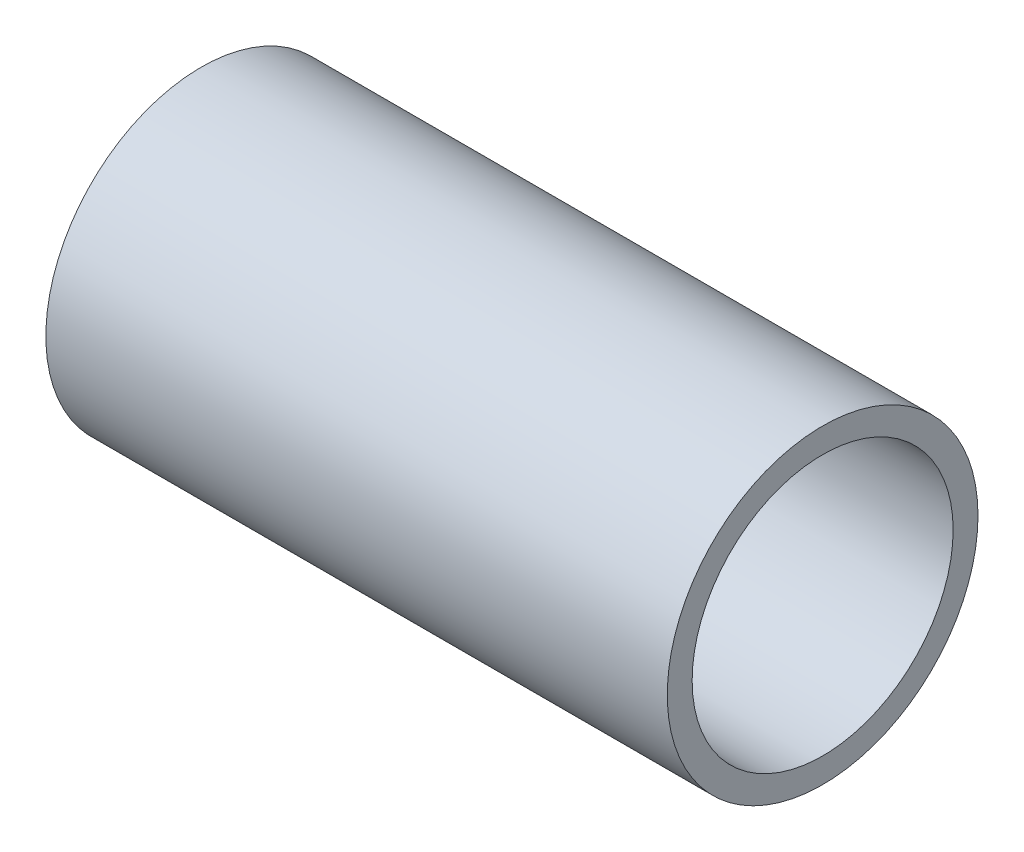
ISO-10303-21;
HEADER;
FILE_DESCRIPTION(('STEP AP214'),'2;1');
FILE_NAME('part.step','',(''),(''),'','','');
FILE_SCHEMA(('AUTOMOTIVE_DESIGN { 1 0 10303 214 1 1 1 1 }'));
ENDSEC;
DATA;
#1=APPLICATION_CONTEXT('core data for automotive mechanical design processes');
#2=APPLICATION_PROTOCOL_DEFINITION('international standard','automotive_design',2000,#1);
#3=PRODUCT_CONTEXT('',#1,'mechanical');
#4=PRODUCT('Part','Part','',(#3));
#5=PRODUCT_RELATED_PRODUCT_CATEGORY('part','',(#4));
#6=PRODUCT_DEFINITION_FORMATION('','',#4);
#7=PRODUCT_DEFINITION_CONTEXT('part definition',#1,'design');
#8=PRODUCT_DEFINITION('design','',#6,#7);
#9=PRODUCT_DEFINITION_SHAPE('','',#8);
#10=(LENGTH_UNIT() NAMED_UNIT(*) SI_UNIT(.MILLI.,.METRE.));
#11=(NAMED_UNIT(*) PLANE_ANGLE_UNIT() SI_UNIT($,.RADIAN.));
#12=(NAMED_UNIT(*) SI_UNIT($,.STERADIAN.) SOLID_ANGLE_UNIT());
#13=UNCERTAINTY_MEASURE_WITH_UNIT(LENGTH_MEASURE(1.E-05),#10,'distance_accuracy_value','');
#14=(GEOMETRIC_REPRESENTATION_CONTEXT(3) GLOBAL_UNCERTAINTY_ASSIGNED_CONTEXT((#13)) GLOBAL_UNIT_ASSIGNED_CONTEXT((#10,
#11,#12)) REPRESENTATION_CONTEXT('',''));
#15=CARTESIAN_POINT('',(0.,0.,0.));
#16=DIRECTION('',(0.,0.,1.));
#17=DIRECTION('',(1.,0.,0.));
#18=AXIS2_PLACEMENT_3D('',#15,#16,#17);
#19=CARTESIAN_POINT('',(38.1,0.,0.));
#20=DIRECTION('',(-1.,0.,0.));
#21=DIRECTION('',(0.,0.,1.));
#22=AXIS2_PLACEMENT_3D('',#19,#20,#21);
#23=CYLINDRICAL_SURFACE('',#22,9.525);
#24=CARTESIAN_POINT('',(38.1,0.,0.));
#25=DIRECTION('',(1.,0.,0.));
#26=DIRECTION('',(0.,0.,-1.));
#27=AXIS2_PLACEMENT_3D('',#24,#25,#26);
#28=CIRCLE('',#27,9.525);
#29=CARTESIAN_POINT('',(38.1,0.,-9.525));
#30=VERTEX_POINT('',#29);
#31=EDGE_CURVE('E10',#30,#30,#28,.T.);
#32=ORIENTED_EDGE('',*,*,#31,.F.);
#33=EDGE_LOOP('',(#32));
#34=FACE_BOUND('',#33,.T.);
#35=CARTESIAN_POINT('',(0.,0.,0.));
#36=DIRECTION('',(1.,0.,0.));
#37=DIRECTION('',(0.,0.,-1.));
#38=AXIS2_PLACEMENT_3D('',#35,#36,#37);
#39=CIRCLE('',#38,9.525);
#40=CARTESIAN_POINT('',(0.,0.,-9.525));
#41=VERTEX_POINT('',#40);
#42=EDGE_CURVE('E35',#41,#41,#39,.T.);
#43=ORIENTED_EDGE('',*,*,#42,.T.);
#44=EDGE_LOOP('',(#43));
#45=FACE_BOUND('',#44,.T.);
#46=ADVANCED_FACE('F32',(#34,#45),#23,.T.);
#47=CARTESIAN_POINT('',(38.1,0.,0.));
#48=DIRECTION('',(1.,0.,0.));
#49=DIRECTION('',(0.,0.,-1.));
#50=AXIS2_PLACEMENT_3D('',#47,#48,#49);
#51=PLANE('',#50);
#52=CARTESIAN_POINT('',(38.1,0.,0.));
#53=DIRECTION('',(-1.,0.,0.));
#54=DIRECTION('',(0.,0.,1.));
#55=AXIS2_PLACEMENT_3D('',#52,#53,#54);
#56=CIRCLE('',#55,8.001);
#57=CARTESIAN_POINT('',(38.1,0.,8.001));
#58=VERTEX_POINT('',#57);
#59=EDGE_CURVE('E47',#58,#58,#56,.T.);
#60=ORIENTED_EDGE('',*,*,#59,.T.);
#61=EDGE_LOOP('',(#60));
#62=FACE_BOUND('',#61,.T.);
#63=ORIENTED_EDGE('',*,*,#31,.T.);
#64=EDGE_LOOP('',(#63));
#65=FACE_BOUND('',#64,.T.);
#66=ADVANCED_FACE('F56',(#62,#65),#51,.T.);
#67=CARTESIAN_POINT('',(0.,0.,0.));
#68=DIRECTION('',(1.,0.,0.));
#69=DIRECTION('',(0.,0.,-1.));
#70=AXIS2_PLACEMENT_3D('',#67,#68,#69);
#71=PLANE('',#70);
#72=CARTESIAN_POINT('',(0.,0.,0.));
#73=DIRECTION('',(-1.,0.,0.));
#74=DIRECTION('',(0.,0.,1.));
#75=AXIS2_PLACEMENT_3D('',#72,#73,#74);
#76=CIRCLE('',#75,8.509);
#77=CARTESIAN_POINT('',(0.,0.,8.509));
#78=VERTEX_POINT('',#77);
#79=EDGE_CURVE('E44',#78,#78,#76,.T.);
#80=ORIENTED_EDGE('',*,*,#79,.F.);
#81=EDGE_LOOP('',(#80));
#82=FACE_BOUND('',#81,.T.);
#83=ORIENTED_EDGE('',*,*,#42,.F.);
#84=EDGE_LOOP('',(#83));
#85=FACE_BOUND('',#84,.T.);
#86=ADVANCED_FACE('F73',(#82,#85),#71,.F.);
#87=CARTESIAN_POINT('',(1.524,0.,0.));
#88=DIRECTION('',(-1.,0.,0.));
#89=DIRECTION('',(0.,0.,1.));
#90=AXIS2_PLACEMENT_3D('',#87,#88,#89);
#91=CYLINDRICAL_SURFACE('',#90,8.509);
#92=CARTESIAN_POINT('',(1.524,0.,0.));
#93=DIRECTION('',(-1.,0.,0.));
#94=DIRECTION('',(0.,0.,1.));
#95=AXIS2_PLACEMENT_3D('',#92,#93,#94);
#96=CIRCLE('',#95,8.509);
#97=CARTESIAN_POINT('',(1.524,0.,8.509));
#98=VERTEX_POINT('',#97);
#99=EDGE_CURVE('E42',#98,#98,#96,.T.);
#100=ORIENTED_EDGE('',*,*,#99,.F.);
#101=EDGE_LOOP('',(#100));
#102=FACE_BOUND('',#101,.T.);
#103=ORIENTED_EDGE('',*,*,#79,.T.);
#104=EDGE_LOOP('',(#103));
#105=FACE_BOUND('',#104,.T.);
#106=ADVANCED_FACE('F67',(#102,#105),#91,.F.);
#107=CARTESIAN_POINT('',(1.524,0.,0.));
#108=DIRECTION('',(-1.,0.,0.));
#109=DIRECTION('',(0.,0.,1.));
#110=AXIS2_PLACEMENT_3D('',#107,#108,#109);
#111=PLANE('',#110);
#112=CARTESIAN_POINT('',(1.524,0.,0.));
#113=DIRECTION('',(-1.,0.,0.));
#114=DIRECTION('',(0.,0.,1.));
#115=AXIS2_PLACEMENT_3D('',#112,#113,#114);
#116=CIRCLE('',#115,8.001);
#117=CARTESIAN_POINT('',(1.524,0.,8.001));
#118=VERTEX_POINT('',#117);
#119=EDGE_CURVE('E50',#118,#118,#116,.T.);
#120=ORIENTED_EDGE('',*,*,#119,.F.);
#121=EDGE_LOOP('',(#120));
#122=FACE_BOUND('',#121,.T.);
#123=ORIENTED_EDGE('',*,*,#99,.T.);
#124=EDGE_LOOP('',(#123));
#125=FACE_BOUND('',#124,.T.);
#126=ADVANCED_FACE('F61',(#122,#125),#111,.T.);
#127=CARTESIAN_POINT('',(38.1,0.,0.));
#128=DIRECTION('',(-1.,0.,0.));
#129=DIRECTION('',(0.,0.,1.));
#130=AXIS2_PLACEMENT_3D('',#127,#128,#129);
#131=CYLINDRICAL_SURFACE('',#130,8.001);
#132=ORIENTED_EDGE('',*,*,#59,.F.);
#133=EDGE_LOOP('',(#132));
#134=FACE_BOUND('',#133,.T.);
#135=ORIENTED_EDGE('',*,*,#119,.T.);
#136=EDGE_LOOP('',(#135));
#137=FACE_BOUND('',#136,.T.);
#138=ADVANCED_FACE('F58',(#134,#137),#131,.F.);
#139=CLOSED_SHELL('',(#46,#66,#86,#106,#126,#138));
#140=MANIFOLD_SOLID_BREP('B2',#139);
#141=ADVANCED_BREP_SHAPE_REPRESENTATION('',(#18,#140),#14);
#142=SHAPE_DEFINITION_REPRESENTATION(#9,#141);
ENDSEC;
END-ISO-10303-21;
